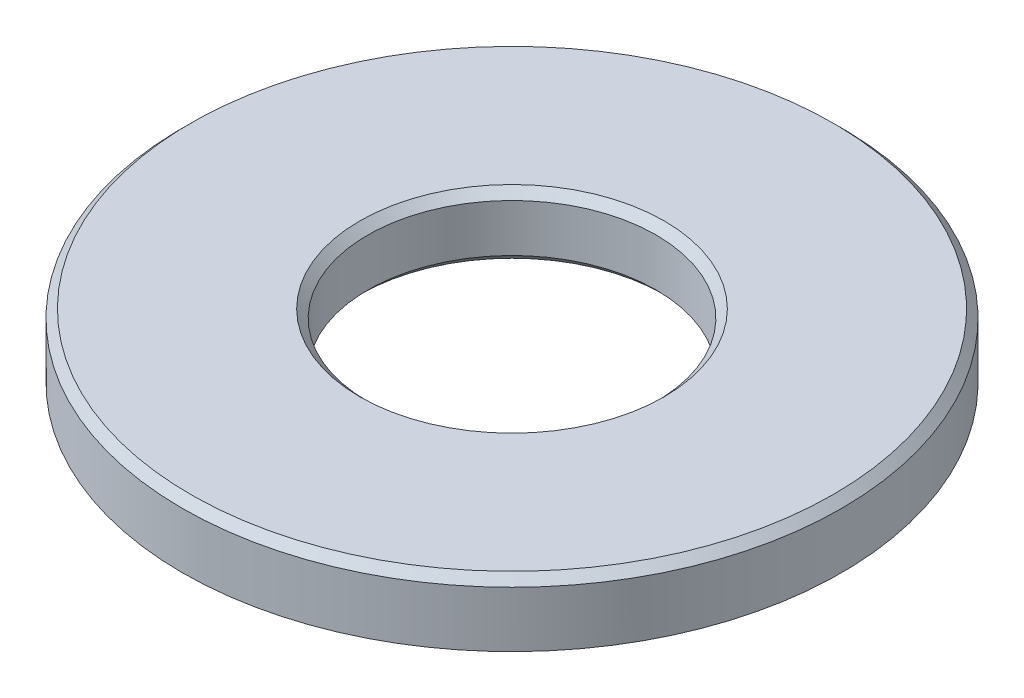
ISO-10303-21;
HEADER;
FILE_DESCRIPTION(('STEP AP214'),'2;1');
FILE_NAME('part.step','',(''),(''),'','','');
FILE_SCHEMA(('AUTOMOTIVE_DESIGN { 1 0 10303 214 1 1 1 1 }'));
ENDSEC;
DATA;
#1=APPLICATION_CONTEXT('core data for automotive mechanical design processes');
#2=APPLICATION_PROTOCOL_DEFINITION('international standard','automotive_design',2000,#1);
#3=PRODUCT_CONTEXT('',#1,'mechanical');
#4=PRODUCT('Part','Part','',(#3));
#5=PRODUCT_RELATED_PRODUCT_CATEGORY('part','',(#4));
#6=PRODUCT_DEFINITION_FORMATION('','',#4);
#7=PRODUCT_DEFINITION_CONTEXT('part definition',#1,'design');
#8=PRODUCT_DEFINITION('design','',#6,#7);
#9=PRODUCT_DEFINITION_SHAPE('','',#8);
#10=(LENGTH_UNIT() NAMED_UNIT(*) SI_UNIT(.MILLI.,.METRE.));
#11=(NAMED_UNIT(*) PLANE_ANGLE_UNIT() SI_UNIT($,.RADIAN.));
#12=(NAMED_UNIT(*) SI_UNIT($,.STERADIAN.) SOLID_ANGLE_UNIT());
#13=UNCERTAINTY_MEASURE_WITH_UNIT(LENGTH_MEASURE(1.E-05),#10,'distance_accuracy_value','');
#14=(GEOMETRIC_REPRESENTATION_CONTEXT(3) GLOBAL_UNCERTAINTY_ASSIGNED_CONTEXT((#13)) GLOBAL_UNIT_ASSIGNED_CONTEXT((#10,
#11,#12)) REPRESENTATION_CONTEXT('',''));
#15=CARTESIAN_POINT('',(0.,0.,0.));
#16=DIRECTION('',(0.,0.,1.));
#17=DIRECTION('',(1.,0.,0.));
#18=AXIS2_PLACEMENT_3D('',#15,#16,#17);
#19=CARTESIAN_POINT('',(0.,0.,0.));
#20=DIRECTION('',(0.,1.,0.));
#21=DIRECTION('',(0.,0.,1.));
#22=AXIS2_PLACEMENT_3D('',#19,#20,#21);
#23=CONICAL_SURFACE('',#22,3.75600000006671,0.785398163539557);
#24=CARTESIAN_POINT('',(0.,-0.199999999999997,0.));
#25=DIRECTION('',(0.,1.,0.));
#26=DIRECTION('',(0.,0.,1.));
#27=AXIS2_PLACEMENT_3D('',#24,#25,#26);
#28=CIRCLE('',#27,3.556);
#29=CARTESIAN_POINT('',(0.,-0.199999999999997,3.556));
#30=VERTEX_POINT('',#29);
#31=EDGE_CURVE('E30',#30,#30,#28,.F.);
#32=ORIENTED_EDGE('',*,*,#31,.T.);
#33=EDGE_LOOP('',(#32));
#34=FACE_BOUND('',#33,.T.);
#35=CARTESIAN_POINT('',(0.,0.,0.));
#36=DIRECTION('',(0.,1.,0.));
#37=DIRECTION('',(0.,0.,1.));
#38=AXIS2_PLACEMENT_3D('',#35,#36,#37);
#39=CIRCLE('',#38,3.75600000006671);
#40=CARTESIAN_POINT('',(0.,0.,3.75600000006671));
#41=VERTEX_POINT('',#40);
#42=EDGE_CURVE('E18',#41,#41,#39,.F.);
#43=ORIENTED_EDGE('',*,*,#42,.F.);
#44=EDGE_LOOP('',(#43));
#45=FACE_BOUND('',#44,.T.);
#46=ADVANCED_FACE('F15',(#34,#45),#23,.F.);
#47=CARTESIAN_POINT('',(3.556,0.,0.));
#48=DIRECTION('',(0.,1.,0.));
#49=DIRECTION('',(0.,0.,1.));
#50=AXIS2_PLACEMENT_3D('',#47,#48,#49);
#51=PLANE('',#50);
#52=CARTESIAN_POINT('',(0.,0.,0.));
#53=DIRECTION('',(0.,-1.,0.));
#54=DIRECTION('',(1.,0.,0.));
#55=AXIS2_PLACEMENT_3D('',#52,#53,#54);
#56=CIRCLE('',#55,7.928);
#57=CARTESIAN_POINT('',(7.928,0.,0.));
#58=VERTEX_POINT('',#57);
#59=EDGE_CURVE('E32',#58,#58,#56,.T.);
#60=ORIENTED_EDGE('',*,*,#59,.F.);
#61=EDGE_LOOP('',(#60));
#62=FACE_BOUND('',#61,.T.);
#63=ORIENTED_EDGE('',*,*,#42,.T.);
#64=EDGE_LOOP('',(#63));
#65=FACE_BOUND('',#64,.T.);
#66=ADVANCED_FACE('F44',(#62,#65),#51,.T.);
#67=CARTESIAN_POINT('',(0.,-1.5748,0.));
#68=DIRECTION('',(0.,1.,0.));
#69=DIRECTION('',(0.,0.,1.));
#70=AXIS2_PLACEMENT_3D('',#67,#68,#69);
#71=CYLINDRICAL_SURFACE('',#70,3.556);
#72=CARTESIAN_POINT('',(0.,-1.37479999995094,0.));
#73=DIRECTION('',(0.,-1.,0.));
#74=DIRECTION('',(0.,0.,-1.));
#75=AXIS2_PLACEMENT_3D('',#72,#73,#74);
#76=CIRCLE('',#75,3.55599999994638);
#77=CARTESIAN_POINT('',(0.,-1.37479999995094,-3.55599999994638));
#78=VERTEX_POINT('',#77);
#79=EDGE_CURVE('E34',#78,#78,#76,.T.);
#80=ORIENTED_EDGE('',*,*,#79,.T.);
#81=EDGE_LOOP('',(#80));
#82=FACE_BOUND('',#81,.T.);
#83=ORIENTED_EDGE('',*,*,#31,.F.);
#84=EDGE_LOOP('',(#83));
#85=FACE_BOUND('',#84,.T.);
#86=ADVANCED_FACE('F51',(#82,#85),#71,.F.);
#87=CARTESIAN_POINT('',(0.,-0.199999999999999,0.));
#88=DIRECTION('',(0.,-1.,0.));
#89=DIRECTION('',(1.,0.,0.));
#90=AXIS2_PLACEMENT_3D('',#87,#88,#89);
#91=CONICAL_SURFACE('',#90,8.128,0.785398163397457);
#92=ORIENTED_EDGE('',*,*,#59,.T.);
#93=EDGE_LOOP('',(#92));
#94=FACE_BOUND('',#93,.T.);
#95=CARTESIAN_POINT('',(0.,-0.199999999999999,0.));
#96=DIRECTION('',(0.,1.,0.));
#97=DIRECTION('',(0.,0.,1.));
#98=AXIS2_PLACEMENT_3D('',#95,#96,#97);
#99=CIRCLE('',#98,8.128);
#100=CARTESIAN_POINT('',(0.,-0.199999999999999,8.128));
#101=VERTEX_POINT('',#100);
#102=EDGE_CURVE('E27',#101,#101,#99,.F.);
#103=ORIENTED_EDGE('',*,*,#102,.F.);
#104=EDGE_LOOP('',(#103));
#105=FACE_BOUND('',#104,.T.);
#106=ADVANCED_FACE('F67',(#94,#105),#91,.T.);
#107=CARTESIAN_POINT('',(0.,-1.57480000007126,0.));
#108=DIRECTION('',(0.,-1.,0.));
#109=DIRECTION('',(1.,0.,0.));
#110=AXIS2_PLACEMENT_3D('',#107,#108,#109);
#111=CONICAL_SURFACE('',#110,3.75600000006671,0.785398163397448);
#112=ORIENTED_EDGE('',*,*,#79,.F.);
#113=EDGE_LOOP('',(#112));
#114=FACE_BOUND('',#113,.T.);
#115=CARTESIAN_POINT('',(0.,-1.57480000001442,0.));
#116=DIRECTION('',(0.,-1.,0.));
#117=DIRECTION('',(1.,0.,0.));
#118=AXIS2_PLACEMENT_3D('',#115,#116,#117);
#119=CIRCLE('',#118,3.75600000000986);
#120=CARTESIAN_POINT('',(3.75600000000986,-1.57480000001442,0.));
#121=VERTEX_POINT('',#120);
#122=EDGE_CURVE('E22',#121,#121,#119,.F.);
#123=ORIENTED_EDGE('',*,*,#122,.F.);
#124=EDGE_LOOP('',(#123));
#125=FACE_BOUND('',#124,.T.);
#126=ADVANCED_FACE('F60',(#114,#125),#111,.F.);
#127=CARTESIAN_POINT('',(0.,-1.5748,0.));
#128=DIRECTION('',(0.,1.,0.));
#129=DIRECTION('',(0.,0.,1.));
#130=AXIS2_PLACEMENT_3D('',#127,#128,#129);
#131=CYLINDRICAL_SURFACE('',#130,8.128);
#132=CARTESIAN_POINT('',(0.,-1.5748,0.));
#133=DIRECTION('',(0.,1.,0.));
#134=DIRECTION('',(0.,0.,1.));
#135=AXIS2_PLACEMENT_3D('',#132,#133,#134);
#136=CIRCLE('',#135,8.128);
#137=CARTESIAN_POINT('',(0.,-1.5748,8.128));
#138=VERTEX_POINT('',#137);
#139=EDGE_CURVE('E10',#138,#138,#136,.F.);
#140=ORIENTED_EDGE('',*,*,#139,.F.);
#141=EDGE_LOOP('',(#140));
#142=FACE_BOUND('',#141,.T.);
#143=ORIENTED_EDGE('',*,*,#102,.T.);
#144=EDGE_LOOP('',(#143));
#145=FACE_BOUND('',#144,.T.);
#146=ADVANCED_FACE('F55',(#142,#145),#131,.T.);
#147=CARTESIAN_POINT('',(8.128,-1.5748,0.));
#148=DIRECTION('',(0.,-1.,0.));
#149=DIRECTION('',(0.,0.,-1.));
#150=AXIS2_PLACEMENT_3D('',#147,#148,#149);
#151=PLANE('',#150);
#152=ORIENTED_EDGE('',*,*,#139,.T.);
#153=EDGE_LOOP('',(#152));
#154=FACE_BOUND('',#153,.T.);
#155=ORIENTED_EDGE('',*,*,#122,.T.);
#156=EDGE_LOOP('',(#155));
#157=FACE_BOUND('',#156,.T.);
#158=ADVANCED_FACE('F53',(#154,#157),#151,.T.);
#159=CLOSED_SHELL('',(#46,#66,#86,#106,#126,#146,#158));
#160=MANIFOLD_SOLID_BREP('B1',#159);
#161=ADVANCED_BREP_SHAPE_REPRESENTATION('',(#18,#160),#14);
#162=SHAPE_DEFINITION_REPRESENTATION(#9,#161);
ENDSEC;
END-ISO-10303-21;
